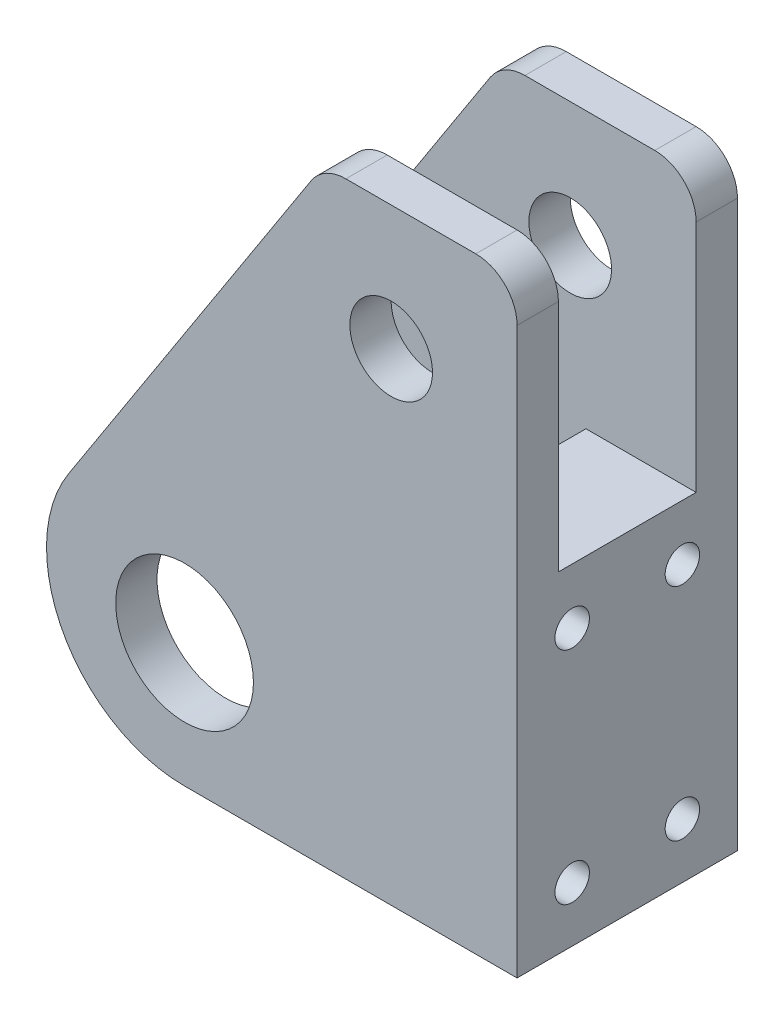
ISO-10303-21;
HEADER;
FILE_DESCRIPTION(('STEP AP214'),'2;1');
FILE_NAME('part.step','',(''),(''),'','','');
FILE_SCHEMA(('AUTOMOTIVE_DESIGN { 1 0 10303 214 1 1 1 1 }'));
ENDSEC;
DATA;
#1=APPLICATION_CONTEXT('core data for automotive mechanical design processes');
#2=APPLICATION_PROTOCOL_DEFINITION('international standard','automotive_design',2000,#1);
#3=PRODUCT_CONTEXT('',#1,'mechanical');
#4=PRODUCT('Part','Part','',(#3));
#5=PRODUCT_RELATED_PRODUCT_CATEGORY('part','',(#4));
#6=PRODUCT_DEFINITION_FORMATION('','',#4);
#7=PRODUCT_DEFINITION_CONTEXT('part definition',#1,'design');
#8=PRODUCT_DEFINITION('design','',#6,#7);
#9=PRODUCT_DEFINITION_SHAPE('','',#8);
#10=(LENGTH_UNIT() NAMED_UNIT(*) SI_UNIT(.MILLI.,.METRE.));
#11=(NAMED_UNIT(*) PLANE_ANGLE_UNIT() SI_UNIT($,.RADIAN.));
#12=(NAMED_UNIT(*) SI_UNIT($,.STERADIAN.) SOLID_ANGLE_UNIT());
#13=UNCERTAINTY_MEASURE_WITH_UNIT(LENGTH_MEASURE(1.E-05),#10,'distance_accuracy_value','');
#14=(GEOMETRIC_REPRESENTATION_CONTEXT(3) GLOBAL_UNCERTAINTY_ASSIGNED_CONTEXT((#13)) GLOBAL_UNIT_ASSIGNED_CONTEXT((#10,
#11,#12)) REPRESENTATION_CONTEXT('',''));
#15=CARTESIAN_POINT('',(0.,0.,0.));
#16=DIRECTION('',(0.,0.,1.));
#17=DIRECTION('',(1.,0.,0.));
#18=AXIS2_PLACEMENT_3D('',#15,#16,#17);
#19=CARTESIAN_POINT('',(-15.4401787467361,14.9761847151675,2.));
#20=DIRECTION('',(0.,0.,-1.));
#21=DIRECTION('',(-1.,0.,0.));
#22=AXIS2_PLACEMENT_3D('',#19,#20,#21);
#23=CYLINDRICAL_SURFACE('',#22,3.00000000000902);
#24=CARTESIAN_POINT('',(-15.4401787467361,14.9761847151675,-1.));
#25=DIRECTION('',(0.,0.,1.));
#26=DIRECTION('',(1.,0.,0.));
#27=AXIS2_PLACEMENT_3D('',#24,#25,#26);
#28=CIRCLE('',#27,3.00000000000902);
#29=CARTESIAN_POINT('',(-12.4401787467271,14.9761847151675,-1.));
#30=VERTEX_POINT('',#29);
#31=EDGE_CURVE('E252',#30,#30,#28,.T.);
#32=ORIENTED_EDGE('',*,*,#31,.F.);
#33=EDGE_LOOP('',(#32));
#34=FACE_BOUND('',#33,.T.);
#35=CARTESIAN_POINT('',(-15.4401787467361,14.9761847151675,2.));
#36=DIRECTION('',(0.,0.,1.));
#37=DIRECTION('',(1.,0.,0.));
#38=AXIS2_PLACEMENT_3D('',#35,#36,#37);
#39=CIRCLE('',#38,3.00000000000902);
#40=CARTESIAN_POINT('',(-12.4401787467271,14.9761847151675,2.));
#41=VERTEX_POINT('',#40);
#42=EDGE_CURVE('E292',#41,#41,#39,.T.);
#43=ORIENTED_EDGE('',*,*,#42,.T.);
#44=EDGE_LOOP('',(#43));
#45=FACE_BOUND('',#44,.T.);
#46=ADVANCED_FACE('F52',(#34,#45),#23,.F.);
#47=CARTESIAN_POINT('',(-20.3596674505297,24.0170657982802,-14.));
#48=DIRECTION('',(0.,1.,0.));
#49=DIRECTION('',(0.,0.,1.));
#50=AXIS2_PLACEMENT_3D('',#47,#48,#49);
#51=PLANE('',#50);
#52=DIRECTION('',(0.,0.,1.));
#53=VECTOR('',#52,1.);
#54=CARTESIAN_POINT('',(-9.29929766362342,24.0170657982802,-14.));
#55=LINE('',#54,#53);
#56=CARTESIAN_POINT('',(-9.29929766362342,24.0170657982802,2.));
#57=VERTEX_POINT('',#56);
#58=CARTESIAN_POINT('',(-9.29929766362342,24.0170657982802,-1.));
#59=VERTEX_POINT('',#58);
#60=EDGE_CURVE('E425',#57,#59,#55,.F.);
#61=ORIENTED_EDGE('',*,*,#60,.T.);
#62=DIRECTION('',(1.,0.,0.));
#63=VECTOR('',#62,1.);
#64=CARTESIAN_POINT('',(-14.2992976636234,24.0170657982802,-1.));
#65=LINE('',#64,#63);
#66=CARTESIAN_POINT('',(-18.7272034358439,24.0170657982802,-1.));
#67=VERTEX_POINT('',#66);
#68=EDGE_CURVE('E210',#67,#59,#65,.T.);
#69=ORIENTED_EDGE('',*,*,#68,.F.);
#70=DIRECTION('',(0.,0.,1.));
#71=VECTOR('',#70,1.);
#72=CARTESIAN_POINT('',(-18.7272034358439,24.0170657982802,2.));
#73=LINE('',#72,#71);
#74=CARTESIAN_POINT('',(-18.7272034358439,24.0170657982802,2.));
#75=VERTEX_POINT('',#74);
#76=EDGE_CURVE('E424',#67,#75,#73,.T.);
#77=ORIENTED_EDGE('',*,*,#76,.T.);
#78=DIRECTION('',(-1.,0.,0.));
#79=VECTOR('',#78,1.);
#80=CARTESIAN_POINT('',(-20.3596674505297,24.0170657982802,2.));
#81=LINE('',#80,#79);
#82=EDGE_CURVE('E267',#57,#75,#81,.T.);
#83=ORIENTED_EDGE('',*,*,#82,.F.);
#84=EDGE_LOOP('',(#61,#69,#77,#83));
#85=FACE_BOUND('',#84,.T.);
#86=ADVANCED_FACE('F380',(#85),#51,.T.);
#87=CARTESIAN_POINT('',(-9.29929766362342,21.0170657982802,-14.));
#88=DIRECTION('',(0.,0.,1.));
#89=DIRECTION('',(1.,0.,0.));
#90=AXIS2_PLACEMENT_3D('',#87,#88,#89);
#91=CYLINDRICAL_SURFACE('',#90,3.);
#92=CARTESIAN_POINT('',(-9.29929766362342,21.0170657982802,-1.));
#93=DIRECTION('',(0.,0.,1.));
#94=DIRECTION('',(1.,0.,0.));
#95=AXIS2_PLACEMENT_3D('',#92,#93,#94);
#96=CIRCLE('',#95,3.);
#97=CARTESIAN_POINT('',(-6.29929766362342,21.0170657982802,-1.));
#98=VERTEX_POINT('',#97);
#99=EDGE_CURVE('E175',#59,#98,#96,.F.);
#100=ORIENTED_EDGE('',*,*,#99,.F.);
#101=ORIENTED_EDGE('',*,*,#60,.F.);
#102=CARTESIAN_POINT('',(-9.29929766362342,21.0170657982802,2.));
#103=DIRECTION('',(0.,0.,1.));
#104=DIRECTION('',(1.,0.,0.));
#105=AXIS2_PLACEMENT_3D('',#102,#103,#104);
#106=CIRCLE('',#105,3.);
#107=CARTESIAN_POINT('',(-6.29929766362342,21.0170657982802,2.));
#108=VERTEX_POINT('',#107);
#109=EDGE_CURVE('E308',#108,#57,#106,.T.);
#110=ORIENTED_EDGE('',*,*,#109,.F.);
#111=DIRECTION('',(0.,0.,1.));
#112=VECTOR('',#111,1.);
#113=CARTESIAN_POINT('',(-6.29929766362342,21.0170657982802,-14.));
#114=LINE('',#113,#112);
#115=EDGE_CURVE('E319',#98,#108,#114,.T.);
#116=ORIENTED_EDGE('',*,*,#115,.F.);
#117=EDGE_LOOP('',(#100,#101,#110,#116));
#118=FACE_BOUND('',#117,.T.);
#119=ADVANCED_FACE('F392',(#118),#91,.T.);
#120=CARTESIAN_POINT('',(-23.0573245291611,19.8461560588481,2.));
#121=DIRECTION('',(0.839677283376447,-0.543085683646283,0.));
#122=DIRECTION('',(0.543085683646283,0.839677283376447,0.));
#123=AXIS2_PLACEMENT_3D('',#120,#121,#122);
#124=PLANE('',#123);
#125=DIRECTION('',(0.,0.,1.));
#126=VECTOR('',#125,1.);
#127=CARTESIAN_POINT('',(-21.2462352859733,22.6463228492191,-14.));
#128=LINE('',#127,#126);
#129=CARTESIAN_POINT('',(-21.2462352859733,22.6463228492191,2.));
#130=VERTEX_POINT('',#129);
#131=CARTESIAN_POINT('',(-21.2462352859733,22.6463228492191,-1.));
#132=VERTEX_POINT('',#131);
#133=EDGE_CURVE('E313',#130,#132,#128,.F.);
#134=ORIENTED_EDGE('',*,*,#133,.T.);
#135=DIRECTION('',(-0.543085683646283,-0.839677283376447,0.));
#136=VECTOR('',#135,1.);
#137=CARTESIAN_POINT('',(-23.0573245291611,19.8461560588481,-1.));
#138=LINE('',#137,#136);
#139=CARTESIAN_POINT('',(-38.8584387418228,-4.58431054326964,-1.));
#140=VERTEX_POINT('',#139);
#141=EDGE_CURVE('E243',#132,#140,#138,.T.);
#142=ORIENTED_EDGE('',*,*,#141,.T.);
#143=DIRECTION('',(0.,0.,1.));
#144=VECTOR('',#143,1.);
#145=CARTESIAN_POINT('',(-38.8584387418228,-4.58431054326963,2.));
#146=LINE('',#145,#144);
#147=CARTESIAN_POINT('',(-38.8584387418228,-4.58431054326963,2.));
#148=VERTEX_POINT('',#147);
#149=EDGE_CURVE('E305',#140,#148,#146,.T.);
#150=ORIENTED_EDGE('',*,*,#149,.T.);
#151=DIRECTION('',(-0.543085683646283,-0.839677283376447,0.));
#152=VECTOR('',#151,1.);
#153=CARTESIAN_POINT('',(-23.0573245291611,19.8461560588481,2.));
#154=LINE('',#153,#152);
#155=EDGE_CURVE('E296',#130,#148,#154,.T.);
#156=ORIENTED_EDGE('',*,*,#155,.F.);
#157=EDGE_LOOP('',(#134,#142,#150,#156));
#158=FACE_BOUND('',#157,.T.);
#159=ADVANCED_FACE('F406',(#158),#124,.F.);
#160=CARTESIAN_POINT('',(-30.4616659080583,-10.0151673797325,2.));
#161=DIRECTION('',(0.,0.,-1.));
#162=DIRECTION('',(-1.,0.,0.));
#163=AXIS2_PLACEMENT_3D('',#160,#161,#162);
#164=CYLINDRICAL_SURFACE('',#163,10.);
#165=CARTESIAN_POINT('',(-30.4616659080583,-10.0151673797325,-1.));
#166=DIRECTION('',(0.,0.,1.));
#167=DIRECTION('',(1.,0.,0.));
#168=AXIS2_PLACEMENT_3D('',#165,#166,#167);
#169=CIRCLE('',#168,10.);
#170=CARTESIAN_POINT('',(-30.4616659080583,-20.0151673797325,-1.));
#171=VERTEX_POINT('',#170);
#172=EDGE_CURVE('E246',#171,#140,#169,.F.);
#173=ORIENTED_EDGE('',*,*,#172,.F.);
#174=DIRECTION('',(0.,0.,1.));
#175=VECTOR('',#174,1.);
#176=CARTESIAN_POINT('',(-30.4616659080583,-20.0151673797325,-14.));
#177=LINE('',#176,#175);
#178=CARTESIAN_POINT('',(-30.4616659080583,-20.0151673797325,2.));
#179=VERTEX_POINT('',#178);
#180=EDGE_CURVE('E437',#179,#171,#177,.F.);
#181=ORIENTED_EDGE('',*,*,#180,.F.);
#182=CARTESIAN_POINT('',(-30.4616659080583,-10.0151673797325,2.));
#183=DIRECTION('',(0.,0.,1.));
#184=DIRECTION('',(1.,0.,0.));
#185=AXIS2_PLACEMENT_3D('',#182,#183,#184);
#186=CIRCLE('',#185,10.);
#187=EDGE_CURVE('E440',#148,#179,#186,.T.);
#188=ORIENTED_EDGE('',*,*,#187,.F.);
#189=ORIENTED_EDGE('',*,*,#149,.F.);
#190=EDGE_LOOP('',(#173,#181,#188,#189));
#191=FACE_BOUND('',#190,.T.);
#192=ADVANCED_FACE('F457',(#191),#164,.T.);
#193=CARTESIAN_POINT('',(-18.7272034358439,21.0170657982802,-14.));
#194=DIRECTION('',(0.,0.,-1.));
#195=DIRECTION('',(-1.,0.,0.));
#196=AXIS2_PLACEMENT_3D('',#193,#194,#195);
#197=CYLINDRICAL_SURFACE('',#196,3.);
#198=CARTESIAN_POINT('',(-18.7272034358439,21.0170657982802,-1.));
#199=DIRECTION('',(0.,0.,1.));
#200=DIRECTION('',(1.,0.,0.));
#201=AXIS2_PLACEMENT_3D('',#198,#199,#200);
#202=CIRCLE('',#201,3.);
#203=EDGE_CURVE('E13',#132,#67,#202,.F.);
#204=ORIENTED_EDGE('',*,*,#203,.F.);
#205=ORIENTED_EDGE('',*,*,#133,.F.);
#206=CARTESIAN_POINT('',(-18.7272034358439,21.0170657982802,2.));
#207=DIRECTION('',(0.,0.,1.));
#208=DIRECTION('',(1.,0.,0.));
#209=AXIS2_PLACEMENT_3D('',#206,#207,#208);
#210=CIRCLE('',#209,3.);
#211=EDGE_CURVE('E310',#75,#130,#210,.T.);
#212=ORIENTED_EDGE('',*,*,#211,.F.);
#213=ORIENTED_EDGE('',*,*,#76,.F.);
#214=EDGE_LOOP('',(#204,#205,#212,#213));
#215=FACE_BOUND('',#214,.T.);
#216=ADVANCED_FACE('F477',(#215),#197,.T.);
#217=CARTESIAN_POINT('',(-30.1727005271502,-9.73411105543774,2.));
#218=DIRECTION('',(0.,0.,1.));
#219=DIRECTION('',(1.,0.,0.));
#220=AXIS2_PLACEMENT_3D('',#217,#218,#219);
#221=PLANE('',#220);
#222=ORIENTED_EDGE('',*,*,#82,.T.);
#223=ORIENTED_EDGE('',*,*,#211,.T.);
#224=ORIENTED_EDGE('',*,*,#155,.T.);
#225=ORIENTED_EDGE('',*,*,#187,.T.);
#226=DIRECTION('',(1.,0.,0.));
#227=VECTOR('',#226,1.);
#228=CARTESIAN_POINT('',(-48.838793814167,-20.0151673797325,2.));
#229=LINE('',#228,#227);
#230=CARTESIAN_POINT('',(-6.29929766362342,-20.0151673797325,2.));
#231=VERTEX_POINT('',#230);
#232=EDGE_CURVE('E284',#179,#231,#229,.T.);
#233=ORIENTED_EDGE('',*,*,#232,.T.);
#234=DIRECTION('',(0.,1.,0.));
#235=VECTOR('',#234,1.);
#236=CARTESIAN_POINT('',(-6.29929766362342,24.0170657982802,2.));
#237=LINE('',#236,#235);
#238=EDGE_CURVE('E272',#231,#108,#237,.T.);
#239=ORIENTED_EDGE('',*,*,#238,.T.);
#240=ORIENTED_EDGE('',*,*,#109,.T.);
#241=EDGE_LOOP('',(#222,#223,#224,#225,#233,#239,#240));
#242=FACE_BOUND('',#241,.T.);
#243=CARTESIAN_POINT('',(-30.4398156149088,-11.0045280375287,2.));
#244=DIRECTION('',(0.,0.,1.));
#245=DIRECTION('',(1.,0.,0.));
#246=AXIS2_PLACEMENT_3D('',#243,#244,#245);
#247=CIRCLE('',#246,5.);
#248=CARTESIAN_POINT('',(-25.4398156149088,-11.0045280375287,2.));
#249=VERTEX_POINT('',#248);
#250=EDGE_CURVE('E259',#249,#249,#247,.T.);
#251=ORIENTED_EDGE('',*,*,#250,.F.);
#252=EDGE_LOOP('',(#251));
#253=FACE_BOUND('',#252,.T.);
#254=ORIENTED_EDGE('',*,*,#42,.F.);
#255=EDGE_LOOP('',(#254));
#256=FACE_BOUND('',#255,.T.);
#257=ADVANCED_FACE('F403',(#242,#253,#256),#221,.T.);
#258=CARTESIAN_POINT('',(-38.8584387418228,-4.58431054326963,-14.));
#259=VERTEX_POINT('',#258);
#260=CARTESIAN_POINT('',(-38.8584387418228,-4.58431054326964,-11.));
#261=VERTEX_POINT('',#260);
#262=EDGE_CURVE('E299',#259,#261,#146,.T.);
#263=ORIENTED_EDGE('',*,*,#262,.T.);
#264=DIRECTION('',(0.543085683646283,0.839677283376447,0.));
#265=VECTOR('',#264,1.);
#266=CARTESIAN_POINT('',(-23.0573245291611,19.8461560588481,-11.));
#267=LINE('',#266,#265);
#268=CARTESIAN_POINT('',(-21.2462352859733,22.6463228492191,-11.));
#269=VERTEX_POINT('',#268);
#270=EDGE_CURVE('E221',#261,#269,#267,.T.);
#271=ORIENTED_EDGE('',*,*,#270,.T.);
#272=CARTESIAN_POINT('',(-21.2462352859733,22.6463228492191,-14.));
#273=VERTEX_POINT('',#272);
#274=EDGE_CURVE('E312',#269,#273,#128,.F.);
#275=ORIENTED_EDGE('',*,*,#274,.T.);
#276=DIRECTION('',(-0.543085683646283,-0.839677283376447,0.));
#277=VECTOR('',#276,1.);
#278=CARTESIAN_POINT('',(-20.3596674505297,24.0170657982802,-14.));
#279=LINE('',#278,#277);
#280=EDGE_CURVE('E271',#273,#259,#279,.T.);
#281=ORIENTED_EDGE('',*,*,#280,.T.);
#282=EDGE_LOOP('',(#263,#271,#275,#281));
#283=FACE_BOUND('',#282,.T.);
#284=ADVANCED_FACE('F398',(#283),#124,.F.);
#285=CARTESIAN_POINT('',(-15.4401787467361,14.9761847151675,-11.));
#286=DIRECTION('',(0.,0.,-1.));
#287=DIRECTION('',(-1.,0.,0.));
#288=AXIS2_PLACEMENT_3D('',#285,#286,#287);
#289=CIRCLE('',#288,3.00000000000902);
#290=CARTESIAN_POINT('',(-18.4401787467451,14.9761847151675,-11.));
#291=VERTEX_POINT('',#290);
#292=EDGE_CURVE('E239',#291,#291,#289,.T.);
#293=ORIENTED_EDGE('',*,*,#292,.F.);
#294=EDGE_LOOP('',(#293));
#295=FACE_BOUND('',#294,.T.);
#296=CARTESIAN_POINT('',(-15.4401787467361,14.9761847151675,-14.));
#297=DIRECTION('',(0.,0.,1.));
#298=DIRECTION('',(1.,0.,0.));
#299=AXIS2_PLACEMENT_3D('',#296,#297,#298);
#300=CIRCLE('',#299,3.);
#301=CARTESIAN_POINT('',(-12.4401787467361,14.9761847151675,-14.));
#302=VERTEX_POINT('',#301);
#303=EDGE_CURVE('E263',#302,#302,#300,.T.);
#304=ORIENTED_EDGE('',*,*,#303,.F.);
#305=EDGE_LOOP('',(#304));
#306=FACE_BOUND('',#305,.T.);
#307=ADVANCED_FACE('F381',(#295,#306),#23,.F.);
#308=CARTESIAN_POINT('',(0.,0.,-14.));
#309=DIRECTION('',(0.,0.,-1.));
#310=DIRECTION('',(-1.,0.,0.));
#311=AXIS2_PLACEMENT_3D('',#308,#309,#310);
#312=PLANE('',#311);
#313=CARTESIAN_POINT('',(-30.4398156149088,-11.0045280375287,-14.));
#314=DIRECTION('',(0.,0.,-1.));
#315=DIRECTION('',(-1.,0.,0.));
#316=AXIS2_PLACEMENT_3D('',#313,#314,#315);
#317=CIRCLE('',#316,5.);
#318=CARTESIAN_POINT('',(-35.4398156149088,-11.0045280375287,-14.));
#319=VERTEX_POINT('',#318);
#320=EDGE_CURVE('E256',#319,#319,#317,.T.);
#321=ORIENTED_EDGE('',*,*,#320,.F.);
#322=EDGE_LOOP('',(#321));
#323=FACE_BOUND('',#322,.T.);
#324=ORIENTED_EDGE('',*,*,#303,.T.);
#325=EDGE_LOOP('',(#324));
#326=FACE_BOUND('',#325,.T.);
#327=ORIENTED_EDGE('',*,*,#280,.F.);
#328=CARTESIAN_POINT('',(-18.7272034358439,21.0170657982802,-14.));
#329=DIRECTION('',(0.,0.,-1.));
#330=DIRECTION('',(-1.,0.,0.));
#331=AXIS2_PLACEMENT_3D('',#328,#329,#330);
#332=CIRCLE('',#331,3.);
#333=CARTESIAN_POINT('',(-18.7272034358439,24.0170657982802,-14.));
#334=VERTEX_POINT('',#333);
#335=EDGE_CURVE('E317',#273,#334,#332,.T.);
#336=ORIENTED_EDGE('',*,*,#335,.T.);
#337=DIRECTION('',(-1.,0.,0.));
#338=VECTOR('',#337,1.);
#339=CARTESIAN_POINT('',(-20.3596674505297,24.0170657982802,-14.));
#340=LINE('',#339,#338);
#341=CARTESIAN_POINT('',(-9.29929766362342,24.0170657982802,-14.));
#342=VERTEX_POINT('',#341);
#343=EDGE_CURVE('E268',#342,#334,#340,.T.);
#344=ORIENTED_EDGE('',*,*,#343,.F.);
#345=CARTESIAN_POINT('',(-9.29929766362342,21.0170657982802,-14.));
#346=DIRECTION('',(0.,0.,-1.));
#347=DIRECTION('',(-1.,0.,0.));
#348=AXIS2_PLACEMENT_3D('',#345,#346,#347);
#349=CIRCLE('',#348,3.);
#350=CARTESIAN_POINT('',(-6.29929766362342,21.0170657982802,-14.));
#351=VERTEX_POINT('',#350);
#352=EDGE_CURVE('E77',#342,#351,#349,.T.);
#353=ORIENTED_EDGE('',*,*,#352,.T.);
#354=DIRECTION('',(0.,1.,0.));
#355=VECTOR('',#354,1.);
#356=CARTESIAN_POINT('',(-6.29929766362342,24.0170657982802,-14.));
#357=LINE('',#356,#355);
#358=CARTESIAN_POINT('',(-6.29929766362342,-20.0151673797325,-14.));
#359=VERTEX_POINT('',#358);
#360=EDGE_CURVE('E277',#359,#351,#357,.T.);
#361=ORIENTED_EDGE('',*,*,#360,.F.);
#362=DIRECTION('',(1.,0.,0.));
#363=VECTOR('',#362,1.);
#364=CARTESIAN_POINT('',(-48.838793814167,-20.0151673797325,-14.));
#365=LINE('',#364,#363);
#366=CARTESIAN_POINT('',(-30.4616659080583,-20.0151673797325,-14.));
#367=VERTEX_POINT('',#366);
#368=EDGE_CURVE('E275',#367,#359,#365,.T.);
#369=ORIENTED_EDGE('',*,*,#368,.F.);
#370=CARTESIAN_POINT('',(-30.4616659080583,-10.0151673797325,-14.));
#371=DIRECTION('',(0.,0.,-1.));
#372=DIRECTION('',(-1.,0.,0.));
#373=AXIS2_PLACEMENT_3D('',#370,#371,#372);
#374=CIRCLE('',#373,10.);
#375=EDGE_CURVE('E416',#367,#259,#374,.T.);
#376=ORIENTED_EDGE('',*,*,#375,.T.);
#377=EDGE_LOOP('',(#327,#336,#344,#353,#361,#369,#376));
#378=FACE_BOUND('',#377,.T.);
#379=ADVANCED_FACE('F370',(#323,#326,#378),#312,.T.);
#380=CARTESIAN_POINT('',(-6.29929766362342,24.0170657982802,-14.));
#381=DIRECTION('',(1.,0.,0.));
#382=DIRECTION('',(0.,1.,0.));
#383=AXIS2_PLACEMENT_3D('',#380,#381,#382);
#384=PLANE('',#383);
#385=CARTESIAN_POINT('',(-6.29929766362342,-0.0151673797324548,-2.));
#386=DIRECTION('',(1.,0.,0.));
#387=DIRECTION('',(0.,0.,-1.));
#388=AXIS2_PLACEMENT_3D('',#385,#386,#387);
#389=CIRCLE('',#388,1.24999999999999);
#390=CARTESIAN_POINT('',(-6.29929766362342,-0.0151673797324548,-3.24999999999999));
#391=VERTEX_POINT('',#390);
#392=EDGE_CURVE('E548',#391,#391,#389,.T.);
#393=ORIENTED_EDGE('',*,*,#392,.F.);
#394=EDGE_LOOP('',(#393));
#395=FACE_BOUND('',#394,.T.);
#396=CARTESIAN_POINT('',(-6.29929766362342,-0.0151673797324548,-10.));
#397=DIRECTION('',(1.,0.,0.));
#398=DIRECTION('',(0.,0.,-1.));
#399=AXIS2_PLACEMENT_3D('',#396,#397,#398);
#400=CIRCLE('',#399,1.24999999999999);
#401=CARTESIAN_POINT('',(-6.29929766362342,-0.0151673797324548,-11.25));
#402=VERTEX_POINT('',#401);
#403=EDGE_CURVE('E342',#402,#402,#400,.T.);
#404=ORIENTED_EDGE('',*,*,#403,.F.);
#405=EDGE_LOOP('',(#404));
#406=FACE_BOUND('',#405,.T.);
#407=CARTESIAN_POINT('',(-6.29929766362342,-16.0151673797325,-2.));
#408=DIRECTION('',(1.,0.,0.));
#409=DIRECTION('',(0.,0.,-1.));
#410=AXIS2_PLACEMENT_3D('',#407,#408,#409);
#411=CIRCLE('',#410,1.24999999999999);
#412=CARTESIAN_POINT('',(-6.29929766362342,-16.0151673797325,-3.24999999999999));
#413=VERTEX_POINT('',#412);
#414=EDGE_CURVE('E333',#413,#413,#411,.T.);
#415=ORIENTED_EDGE('',*,*,#414,.F.);
#416=EDGE_LOOP('',(#415));
#417=FACE_BOUND('',#416,.T.);
#418=CARTESIAN_POINT('',(-6.29929766362342,-16.0151673797325,-10.));
#419=DIRECTION('',(1.,0.,0.));
#420=DIRECTION('',(0.,0.,-1.));
#421=AXIS2_PLACEMENT_3D('',#418,#419,#420);
#422=CIRCLE('',#421,1.24999999999999);
#423=CARTESIAN_POINT('',(-6.29929766362342,-16.0151673797325,-11.25));
#424=VERTEX_POINT('',#423);
#425=EDGE_CURVE('E328',#424,#424,#422,.T.);
#426=ORIENTED_EDGE('',*,*,#425,.F.);
#427=EDGE_LOOP('',(#426));
#428=FACE_BOUND('',#427,.T.);
#429=DIRECTION('',(0.,1.,0.));
#430=VECTOR('',#429,1.);
#431=CARTESIAN_POINT('',(-6.29929766362342,24.0170657982802,-1.));
#432=LINE('',#431,#430);
#433=CARTESIAN_POINT('',(-6.29929766362342,4.01706579828021,-1.));
#434=VERTEX_POINT('',#433);
#435=EDGE_CURVE('E167',#434,#98,#432,.T.);
#436=ORIENTED_EDGE('',*,*,#435,.T.);
#437=ORIENTED_EDGE('',*,*,#115,.T.);
#438=ORIENTED_EDGE('',*,*,#238,.F.);
#439=DIRECTION('',(0.,0.,1.));
#440=VECTOR('',#439,1.);
#441=CARTESIAN_POINT('',(-6.29929766362342,-20.0151673797325,-14.));
#442=LINE('',#441,#440);
#443=EDGE_CURVE('E280',#359,#231,#442,.T.);
#444=ORIENTED_EDGE('',*,*,#443,.F.);
#445=ORIENTED_EDGE('',*,*,#360,.T.);
#446=CARTESIAN_POINT('',(-6.29929766362342,21.0170657982802,-11.));
#447=VERTEX_POINT('',#446);
#448=EDGE_CURVE('E320',#351,#447,#114,.T.);
#449=ORIENTED_EDGE('',*,*,#448,.T.);
#450=DIRECTION('',(0.,-1.,0.));
#451=VECTOR('',#450,1.);
#452=CARTESIAN_POINT('',(-6.29929766362342,24.0170657982802,-11.));
#453=LINE('',#452,#451);
#454=CARTESIAN_POINT('',(-6.29929766362342,4.01706579828021,-11.));
#455=VERTEX_POINT('',#454);
#456=EDGE_CURVE('E180',#447,#455,#453,.T.);
#457=ORIENTED_EDGE('',*,*,#456,.T.);
#458=DIRECTION('',(0.,0.,1.));
#459=VECTOR('',#458,1.);
#460=CARTESIAN_POINT('',(-6.29929766362342,4.01706579828021,-11.));
#461=LINE('',#460,#459);
#462=EDGE_CURVE('E184',#455,#434,#461,.T.);
#463=ORIENTED_EDGE('',*,*,#462,.T.);
#464=EDGE_LOOP('',(#436,#437,#438,#444,#445,#449,#457,#463));
#465=FACE_BOUND('',#464,.T.);
#466=ADVANCED_FACE('F192',(#395,#406,#417,#428,#465),#384,.T.);
#467=DIRECTION('',(-1.,0.,0.));
#468=VECTOR('',#467,1.);
#469=CARTESIAN_POINT('',(-14.2992976636234,24.0170657982802,-11.));
#470=LINE('',#469,#468);
#471=CARTESIAN_POINT('',(-9.29929766362342,24.0170657982802,-11.));
#472=VERTEX_POINT('',#471);
#473=CARTESIAN_POINT('',(-18.7272034358439,24.0170657982802,-11.));
#474=VERTEX_POINT('',#473);
#475=EDGE_CURVE('E69',#472,#474,#470,.T.);
#476=ORIENTED_EDGE('',*,*,#475,.F.);
#477=EDGE_CURVE('E432',#472,#342,#55,.F.);
#478=ORIENTED_EDGE('',*,*,#477,.T.);
#479=ORIENTED_EDGE('',*,*,#343,.T.);
#480=EDGE_CURVE('E306',#334,#474,#73,.T.);
#481=ORIENTED_EDGE('',*,*,#480,.T.);
#482=EDGE_LOOP('',(#476,#478,#479,#481));
#483=FACE_BOUND('',#482,.T.);
#484=ADVANCED_FACE('F369',(#483),#51,.T.);
#485=CARTESIAN_POINT('',(-48.838793814167,-20.0151673797325,-14.));
#486=DIRECTION('',(0.,-1.,0.));
#487=DIRECTION('',(1.,0.,0.));
#488=AXIS2_PLACEMENT_3D('',#485,#486,#487);
#489=PLANE('',#488);
#490=DIRECTION('',(1.,0.,0.));
#491=VECTOR('',#490,1.);
#492=CARTESIAN_POINT('',(-14.2992976636234,-20.0151673797325,-1.));
#493=LINE('',#492,#491);
#494=CARTESIAN_POINT('',(-14.2992976636234,-20.0151673797325,-1.));
#495=VERTEX_POINT('',#494);
#496=EDGE_CURVE('E212',#171,#495,#493,.T.);
#497=ORIENTED_EDGE('',*,*,#496,.T.);
#498=DIRECTION('',(0.,0.,-1.));
#499=VECTOR('',#498,1.);
#500=CARTESIAN_POINT('',(-14.2992976636234,-20.0151673797325,-1.));
#501=LINE('',#500,#499);
#502=CARTESIAN_POINT('',(-14.2992976636234,-20.0151673797325,-11.));
#503=VERTEX_POINT('',#502);
#504=EDGE_CURVE('E223',#495,#503,#501,.T.);
#505=ORIENTED_EDGE('',*,*,#504,.T.);
#506=DIRECTION('',(-1.,0.,0.));
#507=VECTOR('',#506,1.);
#508=CARTESIAN_POINT('',(-14.2992976636234,-20.0151673797325,-11.));
#509=LINE('',#508,#507);
#510=CARTESIAN_POINT('',(-30.4616659080583,-20.0151673797325,-11.));
#511=VERTEX_POINT('',#510);
#512=EDGE_CURVE('E218',#503,#511,#509,.T.);
#513=ORIENTED_EDGE('',*,*,#512,.T.);
#514=EDGE_CURVE('E439',#511,#367,#177,.F.);
#515=ORIENTED_EDGE('',*,*,#514,.T.);
#516=ORIENTED_EDGE('',*,*,#368,.T.);
#517=ORIENTED_EDGE('',*,*,#443,.T.);
#518=ORIENTED_EDGE('',*,*,#232,.F.);
#519=ORIENTED_EDGE('',*,*,#180,.T.);
#520=EDGE_LOOP('',(#497,#505,#513,#515,#516,#517,#518,#519));
#521=FACE_BOUND('',#520,.T.);
#522=ADVANCED_FACE('F377',(#521),#489,.T.);
#523=CARTESIAN_POINT('',(-30.4398156149088,-11.0045280375287,-1.));
#524=DIRECTION('',(0.,0.,1.));
#525=DIRECTION('',(1.,0.,0.));
#526=AXIS2_PLACEMENT_3D('',#523,#524,#525);
#527=CYLINDRICAL_SURFACE('',#526,5.);
#528=CARTESIAN_POINT('',(-30.4398156149088,-11.0045280375287,-1.));
#529=DIRECTION('',(0.,0.,1.));
#530=DIRECTION('',(1.,0.,0.));
#531=AXIS2_PLACEMENT_3D('',#528,#529,#530);
#532=CIRCLE('',#531,5.);
#533=CARTESIAN_POINT('',(-25.4398156149088,-11.0045280375287,-1.));
#534=VERTEX_POINT('',#533);
#535=EDGE_CURVE('E249',#534,#534,#532,.F.);
#536=ORIENTED_EDGE('',*,*,#535,.T.);
#537=EDGE_LOOP('',(#536));
#538=FACE_BOUND('',#537,.T.);
#539=ORIENTED_EDGE('',*,*,#250,.T.);
#540=EDGE_LOOP('',(#539));
#541=FACE_BOUND('',#540,.T.);
#542=ADVANCED_FACE('F501',(#538,#541),#527,.F.);
#543=CARTESIAN_POINT('',(-30.4398156149088,-11.0045280375287,-11.));
#544=DIRECTION('',(0.,0.,-1.));
#545=DIRECTION('',(-1.,0.,0.));
#546=AXIS2_PLACEMENT_3D('',#543,#544,#545);
#547=CYLINDRICAL_SURFACE('',#546,5.);
#548=CARTESIAN_POINT('',(-30.4398156149088,-11.0045280375287,-11.));
#549=DIRECTION('',(0.,0.,-1.));
#550=DIRECTION('',(-1.,0.,0.));
#551=AXIS2_PLACEMENT_3D('',#548,#549,#550);
#552=CIRCLE('',#551,5.);
#553=CARTESIAN_POINT('',(-35.4398156149088,-11.0045280375287,-11.));
#554=VERTEX_POINT('',#553);
#555=EDGE_CURVE('E236',#554,#554,#552,.F.);
#556=ORIENTED_EDGE('',*,*,#555,.T.);
#557=EDGE_LOOP('',(#556));
#558=FACE_BOUND('',#557,.T.);
#559=ORIENTED_EDGE('',*,*,#320,.T.);
#560=EDGE_LOOP('',(#559));
#561=FACE_BOUND('',#560,.T.);
#562=ADVANCED_FACE('F497',(#558,#561),#547,.F.);
#563=CARTESIAN_POINT('',(-30.4616659080583,-10.0151673797325,-11.));
#564=DIRECTION('',(0.,0.,-1.));
#565=DIRECTION('',(-1.,0.,0.));
#566=AXIS2_PLACEMENT_3D('',#563,#564,#565);
#567=CIRCLE('',#566,10.);
#568=EDGE_CURVE('E234',#261,#511,#567,.F.);
#569=ORIENTED_EDGE('',*,*,#568,.F.);
#570=ORIENTED_EDGE('',*,*,#262,.F.);
#571=ORIENTED_EDGE('',*,*,#375,.F.);
#572=ORIENTED_EDGE('',*,*,#514,.F.);
#573=EDGE_LOOP('',(#569,#570,#571,#572));
#574=FACE_BOUND('',#573,.T.);
#575=ADVANCED_FACE('F476',(#574),#164,.T.);
#576=CARTESIAN_POINT('',(-18.7272034358439,21.0170657982802,-11.));
#577=DIRECTION('',(0.,0.,-1.));
#578=DIRECTION('',(-1.,0.,0.));
#579=AXIS2_PLACEMENT_3D('',#576,#577,#578);
#580=CIRCLE('',#579,3.);
#581=EDGE_CURVE('E61',#474,#269,#580,.F.);
#582=ORIENTED_EDGE('',*,*,#581,.F.);
#583=ORIENTED_EDGE('',*,*,#480,.F.);
#584=ORIENTED_EDGE('',*,*,#335,.F.);
#585=ORIENTED_EDGE('',*,*,#274,.F.);
#586=EDGE_LOOP('',(#582,#583,#584,#585));
#587=FACE_BOUND('',#586,.T.);
#588=ADVANCED_FACE('F422',(#587),#197,.T.);
#589=CARTESIAN_POINT('',(-9.29929766362342,21.0170657982802,-11.));
#590=DIRECTION('',(0.,0.,-1.));
#591=DIRECTION('',(0.,1.,0.));
#592=AXIS2_PLACEMENT_3D('',#589,#590,#591);
#593=CIRCLE('',#592,3.);
#594=EDGE_CURVE('E207',#447,#472,#593,.F.);
#595=ORIENTED_EDGE('',*,*,#594,.F.);
#596=ORIENTED_EDGE('',*,*,#448,.F.);
#597=ORIENTED_EDGE('',*,*,#352,.F.);
#598=ORIENTED_EDGE('',*,*,#477,.F.);
#599=EDGE_LOOP('',(#595,#596,#597,#598));
#600=FACE_BOUND('',#599,.T.);
#601=ADVANCED_FACE('F54',(#600),#91,.T.);
#602=CARTESIAN_POINT('',(-14.2992976636234,-57.5940411330503,-1.));
#603=DIRECTION('',(1.,0.,0.));
#604=DIRECTION('',(0.,0.,-1.));
#605=AXIS2_PLACEMENT_3D('',#602,#603,#604);
#606=PLANE('',#605);
#607=CARTESIAN_POINT('',(-14.2992976636234,-0.0151673797324548,-2.));
#608=DIRECTION('',(1.,0.,0.));
#609=DIRECTION('',(0.,0.,-1.));
#610=AXIS2_PLACEMENT_3D('',#607,#608,#609);
#611=CIRCLE('',#610,0.417860258824735);
#612=CARTESIAN_POINT('',(-14.2992976636234,-0.0151673797324548,-2.41786025882474));
#613=VERTEX_POINT('',#612);
#614=EDGE_CURVE('E56',#613,#613,#611,.T.);
#615=ORIENTED_EDGE('',*,*,#614,.T.);
#616=EDGE_LOOP('',(#615));
#617=FACE_BOUND('',#616,.T.);
#618=CARTESIAN_POINT('',(-14.2992976636234,-0.0151673797324548,-10.));
#619=DIRECTION('',(1.,0.,0.));
#620=DIRECTION('',(0.,0.,-1.));
#621=AXIS2_PLACEMENT_3D('',#618,#619,#620);
#622=CIRCLE('',#621,0.417860258824735);
#623=CARTESIAN_POINT('',(-14.2992976636234,-0.0151673797324548,-10.4178602588247));
#624=VERTEX_POINT('',#623);
#625=EDGE_CURVE('E330',#624,#624,#622,.T.);
#626=ORIENTED_EDGE('',*,*,#625,.T.);
#627=EDGE_LOOP('',(#626));
#628=FACE_BOUND('',#627,.T.);
#629=CARTESIAN_POINT('',(-14.2992976636234,-16.0151673797325,-2.));
#630=DIRECTION('',(1.,0.,0.));
#631=DIRECTION('',(0.,0.,-1.));
#632=AXIS2_PLACEMENT_3D('',#629,#630,#631);
#633=CIRCLE('',#632,0.41786025882473);
#634=CARTESIAN_POINT('',(-14.2992976636234,-16.0151673797325,-2.41786025882473));
#635=VERTEX_POINT('',#634);
#636=EDGE_CURVE('E326',#635,#635,#633,.T.);
#637=ORIENTED_EDGE('',*,*,#636,.T.);
#638=EDGE_LOOP('',(#637));
#639=FACE_BOUND('',#638,.T.);
#640=CARTESIAN_POINT('',(-14.2992976636234,-16.0151673797325,-10.));
#641=DIRECTION('',(1.,0.,0.));
#642=DIRECTION('',(0.,0.,-1.));
#643=AXIS2_PLACEMENT_3D('',#640,#641,#642);
#644=CIRCLE('',#643,0.41786025882473);
#645=CARTESIAN_POINT('',(-14.2992976636234,-16.0151673797325,-10.4178602588247));
#646=VERTEX_POINT('',#645);
#647=EDGE_CURVE('E198',#646,#646,#644,.T.);
#648=ORIENTED_EDGE('',*,*,#647,.T.);
#649=EDGE_LOOP('',(#648));
#650=FACE_BOUND('',#649,.T.);
#651=DIRECTION('',(0.,1.,0.));
#652=VECTOR('',#651,1.);
#653=CARTESIAN_POINT('',(-14.2992976636234,-57.5940411330503,-1.));
#654=LINE('',#653,#652);
#655=CARTESIAN_POINT('',(-14.2992976636234,4.01706579828021,-1.));
#656=VERTEX_POINT('',#655);
#657=EDGE_CURVE('E217',#495,#656,#654,.T.);
#658=ORIENTED_EDGE('',*,*,#657,.T.);
#659=DIRECTION('',(0.,0.,1.));
#660=VECTOR('',#659,1.);
#661=CARTESIAN_POINT('',(-14.2992976636234,4.01706579828021,-11.));
#662=LINE('',#661,#660);
#663=CARTESIAN_POINT('',(-14.2992976636234,4.01706579828021,-11.));
#664=VERTEX_POINT('',#663);
#665=EDGE_CURVE('E187',#664,#656,#662,.T.);
#666=ORIENTED_EDGE('',*,*,#665,.F.);
#667=DIRECTION('',(0.,1.,0.));
#668=VECTOR('',#667,1.);
#669=CARTESIAN_POINT('',(-14.2992976636234,-57.5940411330503,-11.));
#670=LINE('',#669,#668);
#671=EDGE_CURVE('E222',#503,#664,#670,.T.);
#672=ORIENTED_EDGE('',*,*,#671,.F.);
#673=ORIENTED_EDGE('',*,*,#504,.F.);
#674=EDGE_LOOP('',(#658,#666,#672,#673));
#675=FACE_BOUND('',#674,.T.);
#676=ADVANCED_FACE('F468',(#617,#628,#639,#650,#675),#606,.F.);
#677=CARTESIAN_POINT('',(-14.2992976636234,-57.5940411330503,-1.));
#678=DIRECTION('',(0.,0.,1.));
#679=DIRECTION('',(1.,0.,0.));
#680=AXIS2_PLACEMENT_3D('',#677,#678,#679);
#681=PLANE('',#680);
#682=ORIENTED_EDGE('',*,*,#31,.T.);
#683=EDGE_LOOP('',(#682));
#684=FACE_BOUND('',#683,.T.);
#685=DIRECTION('',(-1.,0.,0.));
#686=VECTOR('',#685,1.);
#687=CARTESIAN_POINT('',(16.0613821113745,4.01706579828021,-1.));
#688=LINE('',#687,#686);
#689=EDGE_CURVE('E172',#434,#656,#688,.T.);
#690=ORIENTED_EDGE('',*,*,#689,.T.);
#691=ORIENTED_EDGE('',*,*,#657,.F.);
#692=ORIENTED_EDGE('',*,*,#496,.F.);
#693=ORIENTED_EDGE('',*,*,#172,.T.);
#694=ORIENTED_EDGE('',*,*,#141,.F.);
#695=ORIENTED_EDGE('',*,*,#203,.T.);
#696=ORIENTED_EDGE('',*,*,#68,.T.);
#697=ORIENTED_EDGE('',*,*,#99,.T.);
#698=ORIENTED_EDGE('',*,*,#435,.F.);
#699=EDGE_LOOP('',(#690,#691,#692,#693,#694,#695,#696,#697,#698));
#700=FACE_BOUND('',#699,.T.);
#701=ORIENTED_EDGE('',*,*,#535,.F.);
#702=EDGE_LOOP('',(#701));
#703=FACE_BOUND('',#702,.T.);
#704=ADVANCED_FACE('F169',(#684,#700,#703),#681,.F.);
#705=CARTESIAN_POINT('',(-14.2992976636234,-57.5940411330503,-11.));
#706=DIRECTION('',(0.,0.,-1.));
#707=DIRECTION('',(-1.,0.,0.));
#708=AXIS2_PLACEMENT_3D('',#705,#706,#707);
#709=PLANE('',#708);
#710=ORIENTED_EDGE('',*,*,#671,.T.);
#711=DIRECTION('',(-1.,0.,0.));
#712=VECTOR('',#711,1.);
#713=CARTESIAN_POINT('',(16.0613821113745,4.01706579828021,-11.));
#714=LINE('',#713,#712);
#715=EDGE_CURVE('E203',#455,#664,#714,.T.);
#716=ORIENTED_EDGE('',*,*,#715,.F.);
#717=ORIENTED_EDGE('',*,*,#456,.F.);
#718=ORIENTED_EDGE('',*,*,#594,.T.);
#719=ORIENTED_EDGE('',*,*,#475,.T.);
#720=ORIENTED_EDGE('',*,*,#581,.T.);
#721=ORIENTED_EDGE('',*,*,#270,.F.);
#722=ORIENTED_EDGE('',*,*,#568,.T.);
#723=ORIENTED_EDGE('',*,*,#512,.F.);
#724=EDGE_LOOP('',(#710,#716,#717,#718,#719,#720,#721,#722,#723));
#725=FACE_BOUND('',#724,.T.);
#726=ORIENTED_EDGE('',*,*,#292,.T.);
#727=EDGE_LOOP('',(#726));
#728=FACE_BOUND('',#727,.T.);
#729=ORIENTED_EDGE('',*,*,#555,.F.);
#730=EDGE_LOOP('',(#729));
#731=FACE_BOUND('',#730,.T.);
#732=ADVANCED_FACE('F484',(#725,#728,#731),#709,.F.);
#733=CARTESIAN_POINT('',(16.0613821113745,4.01706579828021,-11.));
#734=DIRECTION('',(0.,-1.,0.));
#735=DIRECTION('',(0.,0.,-1.));
#736=AXIS2_PLACEMENT_3D('',#733,#734,#735);
#737=PLANE('',#736);
#738=ORIENTED_EDGE('',*,*,#715,.T.);
#739=ORIENTED_EDGE('',*,*,#665,.T.);
#740=ORIENTED_EDGE('',*,*,#689,.F.);
#741=ORIENTED_EDGE('',*,*,#462,.F.);
#742=EDGE_LOOP('',(#738,#739,#740,#741));
#743=FACE_BOUND('',#742,.T.);
#744=ADVANCED_FACE('F183',(#743),#737,.F.);
#745=CARTESIAN_POINT('',(-13.7992976636234,-16.0151673797325,-10.));
#746=DIRECTION('',(1.,0.,0.));
#747=DIRECTION('',(0.,0.,-1.));
#748=AXIS2_PLACEMENT_3D('',#745,#746,#747);
#749=CONICAL_SURFACE('',#748,1.24999999999999,1.02974425867665);
#750=CARTESIAN_POINT('',(-13.7992976636234,-16.0151673797325,-10.));
#751=DIRECTION('',(1.,0.,0.));
#752=DIRECTION('',(0.,0.,-1.));
#753=AXIS2_PLACEMENT_3D('',#750,#751,#752);
#754=CIRCLE('',#753,1.24999999999999);
#755=CARTESIAN_POINT('',(-13.7992976636234,-16.0151673797325,-11.25));
#756=VERTEX_POINT('',#755);
#757=EDGE_CURVE('E325',#756,#756,#754,.T.);
#758=ORIENTED_EDGE('',*,*,#757,.T.);
#759=EDGE_LOOP('',(#758));
#760=FACE_BOUND('',#759,.T.);
#761=ORIENTED_EDGE('',*,*,#647,.F.);
#762=EDGE_LOOP('',(#761));
#763=FACE_BOUND('',#762,.T.);
#764=ADVANCED_FACE('F358',(#760,#763),#749,.F.);
#765=CARTESIAN_POINT('',(-6.29929766362342,-16.0151673797325,-10.));
#766=DIRECTION('',(1.,0.,0.));
#767=DIRECTION('',(0.,0.,-1.));
#768=AXIS2_PLACEMENT_3D('',#765,#766,#767);
#769=CYLINDRICAL_SURFACE('',#768,1.24999999999999);
#770=ORIENTED_EDGE('',*,*,#757,.F.);
#771=EDGE_LOOP('',(#770));
#772=FACE_BOUND('',#771,.T.);
#773=ORIENTED_EDGE('',*,*,#425,.T.);
#774=EDGE_LOOP('',(#773));
#775=FACE_BOUND('',#774,.T.);
#776=ADVANCED_FACE('F361',(#772,#775),#769,.F.);
#777=CARTESIAN_POINT('',(-13.7992976636234,-16.0151673797325,-2.));
#778=DIRECTION('',(1.,0.,0.));
#779=DIRECTION('',(0.,0.,-1.));
#780=AXIS2_PLACEMENT_3D('',#777,#778,#779);
#781=CONICAL_SURFACE('',#780,1.24999999999999,1.02974425867665);
#782=CARTESIAN_POINT('',(-13.7992976636234,-16.0151673797325,-2.));
#783=DIRECTION('',(1.,0.,0.));
#784=DIRECTION('',(0.,0.,-1.));
#785=AXIS2_PLACEMENT_3D('',#782,#783,#784);
#786=CIRCLE('',#785,1.24999999999999);
#787=CARTESIAN_POINT('',(-13.7992976636234,-16.0151673797325,-3.24999999999999));
#788=VERTEX_POINT('',#787);
#789=EDGE_CURVE('E329',#788,#788,#786,.T.);
#790=ORIENTED_EDGE('',*,*,#789,.T.);
#791=EDGE_LOOP('',(#790));
#792=FACE_BOUND('',#791,.T.);
#793=ORIENTED_EDGE('',*,*,#636,.F.);
#794=EDGE_LOOP('',(#793));
#795=FACE_BOUND('',#794,.T.);
#796=ADVANCED_FACE('F364',(#792,#795),#781,.F.);
#797=CARTESIAN_POINT('',(-6.29929766362342,-16.0151673797325,-2.));
#798=DIRECTION('',(1.,0.,0.));
#799=DIRECTION('',(0.,0.,-1.));
#800=AXIS2_PLACEMENT_3D('',#797,#798,#799);
#801=CYLINDRICAL_SURFACE('',#800,1.24999999999999);
#802=ORIENTED_EDGE('',*,*,#789,.F.);
#803=EDGE_LOOP('',(#802));
#804=FACE_BOUND('',#803,.T.);
#805=ORIENTED_EDGE('',*,*,#414,.T.);
#806=EDGE_LOOP('',(#805));
#807=FACE_BOUND('',#806,.T.);
#808=ADVANCED_FACE('F522',(#804,#807),#801,.F.);
#809=CARTESIAN_POINT('',(-13.7992976636234,-0.0151673797324548,-10.));
#810=DIRECTION('',(1.,0.,0.));
#811=DIRECTION('',(0.,0.,-1.));
#812=AXIS2_PLACEMENT_3D('',#809,#810,#811);
#813=CONICAL_SURFACE('',#812,1.24999999999999,1.02974425867665);
#814=CARTESIAN_POINT('',(-13.7992976636234,-0.0151673797324548,-10.));
#815=DIRECTION('',(1.,0.,0.));
#816=DIRECTION('',(0.,0.,-1.));
#817=AXIS2_PLACEMENT_3D('',#814,#815,#816);
#818=CIRCLE('',#817,1.24999999999999);
#819=CARTESIAN_POINT('',(-13.7992976636234,-0.0151673797324548,-11.25));
#820=VERTEX_POINT('',#819);
#821=EDGE_CURVE('E334',#820,#820,#818,.T.);
#822=ORIENTED_EDGE('',*,*,#821,.T.);
#823=EDGE_LOOP('',(#822));
#824=FACE_BOUND('',#823,.T.);
#825=ORIENTED_EDGE('',*,*,#625,.F.);
#826=EDGE_LOOP('',(#825));
#827=FACE_BOUND('',#826,.T.);
#828=ADVANCED_FACE('F526',(#824,#827),#813,.F.);
#829=CARTESIAN_POINT('',(-6.29929766362342,-0.0151673797324548,-10.));
#830=DIRECTION('',(1.,0.,0.));
#831=DIRECTION('',(0.,0.,-1.));
#832=AXIS2_PLACEMENT_3D('',#829,#830,#831);
#833=CYLINDRICAL_SURFACE('',#832,1.24999999999999);
#834=ORIENTED_EDGE('',*,*,#821,.F.);
#835=EDGE_LOOP('',(#834));
#836=FACE_BOUND('',#835,.T.);
#837=ORIENTED_EDGE('',*,*,#403,.T.);
#838=EDGE_LOOP('',(#837));
#839=FACE_BOUND('',#838,.T.);
#840=ADVANCED_FACE('F530',(#836,#839),#833,.F.);
#841=CARTESIAN_POINT('',(-13.7992976636234,-0.0151673797324548,-2.));
#842=DIRECTION('',(1.,0.,0.));
#843=DIRECTION('',(0.,0.,-1.));
#844=AXIS2_PLACEMENT_3D('',#841,#842,#843);
#845=CONICAL_SURFACE('',#844,1.24999999999999,1.02974425867665);
#846=CARTESIAN_POINT('',(-13.7992976636234,-0.0151673797324548,-2.));
#847=DIRECTION('',(1.,0.,0.));
#848=DIRECTION('',(0.,0.,-1.));
#849=AXIS2_PLACEMENT_3D('',#846,#847,#848);
#850=CIRCLE('',#849,1.24999999999999);
#851=CARTESIAN_POINT('',(-13.7992976636234,-0.0151673797324548,-3.24999999999999));
#852=VERTEX_POINT('',#851);
#853=EDGE_CURVE('E546',#852,#852,#850,.T.);
#854=ORIENTED_EDGE('',*,*,#853,.T.);
#855=EDGE_LOOP('',(#854));
#856=FACE_BOUND('',#855,.T.);
#857=ORIENTED_EDGE('',*,*,#614,.F.);
#858=EDGE_LOOP('',(#857));
#859=FACE_BOUND('',#858,.T.);
#860=ADVANCED_FACE('F533',(#856,#859),#845,.F.);
#861=CARTESIAN_POINT('',(-6.29929766362342,-0.0151673797324548,-2.));
#862=DIRECTION('',(1.,0.,0.));
#863=DIRECTION('',(0.,0.,-1.));
#864=AXIS2_PLACEMENT_3D('',#861,#862,#863);
#865=CYLINDRICAL_SURFACE('',#864,1.24999999999999);
#866=ORIENTED_EDGE('',*,*,#853,.F.);
#867=EDGE_LOOP('',(#866));
#868=FACE_BOUND('',#867,.T.);
#869=ORIENTED_EDGE('',*,*,#392,.T.);
#870=EDGE_LOOP('',(#869));
#871=FACE_BOUND('',#870,.T.);
#872=ADVANCED_FACE('F537',(#868,#871),#865,.F.);
#873=CLOSED_SHELL('',(#46,#86,#119,#159,#192,#216,#257,#284,#307,#379,#466,#484,#522,#542,#562,
#575,#588,#601,#676,#704,#732,#744,#764,#776,#796,#808,#828,#840,#860,#872));
#874=MANIFOLD_SOLID_BREP('B2',#873);
#875=ADVANCED_BREP_SHAPE_REPRESENTATION('',(#18,#874),#14);
#876=SHAPE_DEFINITION_REPRESENTATION(#9,#875);
ENDSEC;
END-ISO-10303-21;
